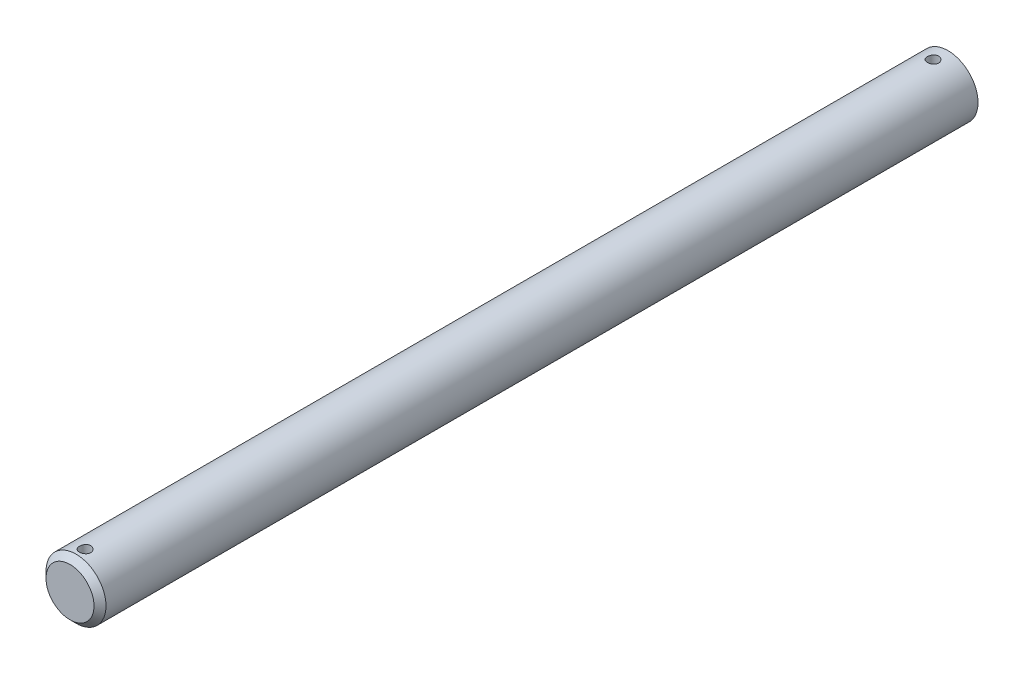
ISO-10303-21;
HEADER;
FILE_DESCRIPTION(('STEP AP214'),'2;1');
FILE_NAME('part.step','',(''),(''),'','','');
FILE_SCHEMA(('AUTOMOTIVE_DESIGN { 1 0 10303 214 1 1 1 1 }'));
ENDSEC;
DATA;
#1=APPLICATION_CONTEXT('core data for automotive mechanical design processes');
#2=APPLICATION_PROTOCOL_DEFINITION('international standard','automotive_design',2000,#1);
#3=PRODUCT_CONTEXT('',#1,'mechanical');
#4=PRODUCT('Part','Part','',(#3));
#5=PRODUCT_RELATED_PRODUCT_CATEGORY('part','',(#4));
#6=PRODUCT_DEFINITION_FORMATION('','',#4);
#7=PRODUCT_DEFINITION_CONTEXT('part definition',#1,'design');
#8=PRODUCT_DEFINITION('design','',#6,#7);
#9=PRODUCT_DEFINITION_SHAPE('','',#8);
#10=(LENGTH_UNIT() NAMED_UNIT(*) SI_UNIT(.MILLI.,.METRE.));
#11=(NAMED_UNIT(*) PLANE_ANGLE_UNIT() SI_UNIT($,.RADIAN.));
#12=(NAMED_UNIT(*) SI_UNIT($,.STERADIAN.) SOLID_ANGLE_UNIT());
#13=UNCERTAINTY_MEASURE_WITH_UNIT(LENGTH_MEASURE(1.E-05),#10,'distance_accuracy_value','');
#14=(GEOMETRIC_REPRESENTATION_CONTEXT(3) GLOBAL_UNCERTAINTY_ASSIGNED_CONTEXT((#13)) GLOBAL_UNIT_ASSIGNED_CONTEXT((#10,
#11,#12)) REPRESENTATION_CONTEXT('',''));
#15=CARTESIAN_POINT('',(0.,0.,0.));
#16=DIRECTION('',(0.,0.,1.));
#17=DIRECTION('',(1.,0.,0.));
#18=AXIS2_PLACEMENT_3D('',#15,#16,#17);
#19=CARTESIAN_POINT('',(0.,0.,304.8));
#20=DIRECTION('',(0.,0.,-1.));
#21=DIRECTION('',(-1.,0.,0.));
#22=AXIS2_PLACEMENT_3D('',#19,#20,#21);
#23=CYLINDRICAL_SURFACE('',#22,3.175);
#24=CARTESIAN_POINT('',(0.,-3.17500000000001,214.055762388));
#25=CARTESIAN_POINT('',(0.0331278493784855,-3.17499940005936,214.055761122132));
#26=CARTESIAN_POINT('',(0.0662721689897595,-3.17447616437681,214.052987804467));
#27=CARTESIAN_POINT('',(0.131626820280965,-3.17243930650301,214.041974952437));
#28=CARTESIAN_POINT('',(0.163836339741666,-3.17092484847488,214.033730804777));
#29=CARTESIAN_POINT('',(0.226366769234933,-3.16707495697542,214.012037597188));
#30=CARTESIAN_POINT('',(0.256689356240744,-3.16474026510011,213.998593237808));
#31=CARTESIAN_POINT('',(0.314645664321682,-3.1595048514429,213.966894583721));
#32=CARTESIAN_POINT('',(0.342279602808186,-3.1566041754851,213.948640678371));
#33=CARTESIAN_POINT('',(0.394407912259917,-3.15051811645857,213.907609042574));
#34=CARTESIAN_POINT('',(0.418865429028259,-3.14733001333615,213.884784889647));
#35=CARTESIAN_POINT('',(0.46362781184975,-3.14104860763278,213.835360512206));
#36=CARTESIAN_POINT('',(0.483932379579181,-3.13795531187579,213.808760016654));
#37=CARTESIAN_POINT('',(0.51996577595487,-3.13218731275362,213.752277596681));
#38=CARTESIAN_POINT('',(0.535657115316877,-3.12951611636079,213.72237136603));
#39=CARTESIAN_POINT('',(0.561778643443755,-3.12493308056008,213.660288787289));
#40=CARTESIAN_POINT('',(0.572209285923864,-3.1230211756692,213.628112635243));
#41=CARTESIAN_POINT('',(0.587395056092025,-3.120200569874,213.562797905731));
#42=CARTESIAN_POINT('',(0.592214454824666,-3.11928051754792,213.529674771297));
#43=CARTESIAN_POINT('',(0.596240425878417,-3.11851356370003,213.463078238404));
#44=CARTESIAN_POINT('',(0.595447501537276,-3.11866656594196,213.429604871624));
#45=CARTESIAN_POINT('',(0.588323450296884,-3.12001809916009,213.36372370141));
#46=CARTESIAN_POINT('',(0.582065407796811,-3.12120283233474,213.331307670137));
#47=CARTESIAN_POINT('',(0.564303860103705,-3.12446266491103,213.267993921399));
#48=CARTESIAN_POINT('',(0.552800132013024,-3.12653780214715,213.237096268514));
#49=CARTESIAN_POINT('',(0.524802287242859,-3.13135905069247,213.177482506022));
#50=CARTESIAN_POINT('',(0.508278659956946,-3.13410911079899,213.148780588738));
#51=CARTESIAN_POINT('',(0.470730932942595,-3.13996773104909,213.094529261361));
#52=CARTESIAN_POINT('',(0.449706376466777,-3.14307632756161,213.068980171626));
#53=CARTESIAN_POINT('',(0.403359563188525,-3.14936188004891,213.021337483717));
#54=CARTESIAN_POINT('',(0.377974795254084,-3.15253914125163,212.999304691558));
#55=CARTESIAN_POINT('',(0.323837314723604,-3.1585590011174,212.959801108107));
#56=CARTESIAN_POINT('',(0.29508456836402,-3.16140159642489,212.942330362555));
#57=CARTESIAN_POINT('',(0.234963886209648,-3.16643757934512,212.912437841933));
#58=CARTESIAN_POINT('',(0.203592733389713,-3.16863015282215,212.900022391288));
#59=CARTESIAN_POINT('',(0.139159898923863,-3.17211275581705,212.880654369804));
#60=CARTESIAN_POINT('',(0.106098397260249,-3.17340288121049,212.873701218644));
#61=CARTESIAN_POINT('',(0.0397464966210302,-3.17492205629787,212.86553980694));
#62=CARTESIAN_POINT('',(0.00646668626417154,-3.17516649268312,212.864248232612));
#63=CARTESIAN_POINT('',(-0.0598333703365863,-3.17460925115548,212.867223156445));
#64=CARTESIAN_POINT('',(-0.0928536292531536,-3.1738076246401,212.871489381529));
#65=CARTESIAN_POINT('',(-0.15743299937098,-3.17125791126725,212.885389536338));
#66=CARTESIAN_POINT('',(-0.189001503602657,-3.16951726067194,212.894981309507));
#67=CARTESIAN_POINT('',(-0.2500823007554,-3.16528387378086,212.919214665378));
#68=CARTESIAN_POINT('',(-0.279594453904928,-3.16279108642312,212.93385659094));
#69=CARTESIAN_POINT('',(-0.336080366506804,-3.157291557982,212.967959020113));
#70=CARTESIAN_POINT('',(-0.363022863065377,-3.1542794982553,212.987470431107));
#71=CARTESIAN_POINT('',(-0.413281147045618,-3.1480892694748,213.030689086266));
#72=CARTESIAN_POINT('',(-0.436596595436343,-3.14491108492986,213.054396722222));
#73=CARTESIAN_POINT('',(-0.479255517992192,-3.13869576292426,213.105712027068));
#74=CARTESIAN_POINT('',(-0.498542136242482,-3.1356610588829,213.133367304662));
#75=CARTESIAN_POINT('',(-0.532196179135602,-3.13012528651481,213.191574070233));
#76=CARTESIAN_POINT('',(-0.54656378659277,-3.12762419835761,213.222125450522));
#77=CARTESIAN_POINT('',(-0.569891360504025,-3.12345793983175,213.285112841562));
#78=CARTESIAN_POINT('',(-0.578877385529317,-3.12178874798387,213.317538923013));
#79=CARTESIAN_POINT('',(-0.591267071076003,-3.11946609009084,213.383474879438));
#80=CARTESIAN_POINT('',(-0.594671361418129,-3.11881250944861,213.416984631701));
#81=CARTESIAN_POINT('',(-0.595779868526289,-3.11860088672157,213.483567194541));
#82=CARTESIAN_POINT('',(-0.593573770795141,-3.11902560714799,213.516638490442));
#83=CARTESIAN_POINT('',(-0.583720477284627,-3.12088450886938,213.581929921124));
#84=CARTESIAN_POINT('',(-0.576073314010791,-3.12231868413375,213.614150060988));
#85=CARTESIAN_POINT('',(-0.555592803846081,-3.126027641217,213.676776324153));
#86=CARTESIAN_POINT('',(-0.542769168607848,-3.12830084823628,213.70718572269));
#87=CARTESIAN_POINT('',(-0.512309542245316,-3.13343285059637,213.765435726402));
#88=CARTESIAN_POINT('',(-0.494673211138123,-3.13629168730423,213.79327614991));
#89=CARTESIAN_POINT('',(-0.454777027878797,-3.14232633736512,213.846047161017));
#90=CARTESIAN_POINT('',(-0.432451906336473,-3.1455062556199,213.870927942363));
#91=CARTESIAN_POINT('',(-0.383947958425861,-3.15179405961499,213.916620061853));
#92=CARTESIAN_POINT('',(-0.357768247938244,-3.15490192863972,213.937430463827));
#93=CARTESIAN_POINT('',(-0.3020159000754,-3.1607282796232,213.974566109824));
#94=CARTESIAN_POINT('',(-0.272414837535452,-3.1634430039313,213.990849286182));
#95=CARTESIAN_POINT('',(-0.210855763856357,-3.16814048941711,214.018185325028));
#96=CARTESIAN_POINT('',(-0.17889999927051,-3.17012393770744,214.029243100109));
#97=CARTESIAN_POINT('',(-0.122375296121221,-3.17273102874592,214.04356932216));
#98=CARTESIAN_POINT('',(-0.0981367934437003,-3.17357708754789,214.048133906905));
#99=CARTESIAN_POINT('',(-0.049268557448821,-3.17471178919249,214.054230872027));
#100=CARTESIAN_POINT('',(-0.0246388340934145,-3.1750004462058,214.055763329489));
#101=CARTESIAN_POINT('',(0.,-3.17500000000001,214.055762388));
#102=B_SPLINE_CURVE_WITH_KNOTS('',3,(#24,#25,#26,#27,#28,#29,#30,#31,#32,#33,#34,#35,#36,#37,
#38,#39,#40,#41,#42,#43,#44,#45,#46,#47,#48,#49,#50,#51,#52,#53,#54,#55,#56,#57,#58,#59,#60,#61,
#62,#63,#64,#65,#66,#67,#68,#69,#70,#71,#72,#73,#74,#75,#76,#77,#78,#79,#80,#81,#82,#83,#84,#85,
#86,#87,#88,#89,#90,#91,#92,#93,#94,#95,#96,#97,#98,#99,#100,#101),.UNSPECIFIED.,.T.,.F.,(4,2,2,
2,2,2,2,2,2,2,2,2,2,2,2,2,2,2,2,2,2,2,2,2,2,2,2,2,2,2,2,2,2,2,2,2,2,2,4),(0.,0.0992934422579541,
0.198670720631257,0.29795837951975,0.397238003055786,0.49758249961658,0.59793420181311,
0.699080193564175,0.800217460363053,0.900184538548712,1.00014265136194,1.09878415868193,
1.19742985782943,1.29666707356097,1.3959143645104,1.49672583109182,1.59753830838152,
1.69847652240176,1.79940401117395,1.89884119086454,1.99827348496884,2.09692967832172,
2.19559257087284,2.2953336190078,2.3950839846395,2.49615895304337,2.59723016460248,
2.69780792915497,2.79837434413152,2.89734328229483,2.99631162921165,3.09509515682432,
3.19388566460124,3.2941552495541,3.39444786907213,3.49564344413668,3.59674369125816,
3.67059505483131,3.74444454087573),.UNSPECIFIED.);
#103=CARTESIAN_POINT('',(0.,-3.17500000000001,214.055762388));
#104=VERTEX_POINT('',#103);
#105=EDGE_CURVE('E10',#104,#104,#102,.T.);
#106=ORIENTED_EDGE('',*,*,#105,.T.);
#107=EDGE_LOOP('',(#106));
#108=FACE_BOUND('',#107,.T.);
#109=CARTESIAN_POINT('',(0.,3.17499999999999,214.055762388));
#110=CARTESIAN_POINT('',(-0.033127849378482,3.17499940005934,214.055761122132));
#111=CARTESIAN_POINT('',(-0.0662721689897559,3.1744761643768,214.052987804467));
#112=CARTESIAN_POINT('',(-0.131626820280961,3.17243930650299,214.041974952437));
#113=CARTESIAN_POINT('',(-0.163836339741662,3.17092484847486,214.033730804777));
#114=CARTESIAN_POINT('',(-0.22636676923493,3.1670749569754,214.012037597188));
#115=CARTESIAN_POINT('',(-0.256689356240741,3.16474026510009,213.998593237808));
#116=CARTESIAN_POINT('',(-0.314645664321678,3.15950485144288,213.966894583721));
#117=CARTESIAN_POINT('',(-0.342279602808182,3.15660417548508,213.948640678371));
#118=CARTESIAN_POINT('',(-0.394407912259913,3.15051811645855,213.907609042574));
#119=CARTESIAN_POINT('',(-0.418865429028255,3.14733001333614,213.884784889647));
#120=CARTESIAN_POINT('',(-0.463627811849747,3.14104860763276,213.835360512206));
#121=CARTESIAN_POINT('',(-0.483932379579178,3.13795531187577,213.808760016654));
#122=CARTESIAN_POINT('',(-0.519965775954866,3.13218731275361,213.752277596681));
#123=CARTESIAN_POINT('',(-0.535657115316873,3.12951611636078,213.72237136603));
#124=CARTESIAN_POINT('',(-0.561778643443751,3.12493308056006,213.660288787289));
#125=CARTESIAN_POINT('',(-0.57220928592386,3.12302117566918,213.628112635243));
#126=CARTESIAN_POINT('',(-0.587395056092021,3.12020056987398,213.562797905731));
#127=CARTESIAN_POINT('',(-0.592214454824663,3.11928051754791,213.529674771297));
#128=CARTESIAN_POINT('',(-0.596240425878413,3.11851356370001,213.463078238404));
#129=CARTESIAN_POINT('',(-0.595447501537272,3.11866656594194,213.429604871624));
#130=CARTESIAN_POINT('',(-0.588323450296881,3.12001809916007,213.36372370141));
#131=CARTESIAN_POINT('',(-0.582065407796807,3.12120283233472,213.331307670137));
#132=CARTESIAN_POINT('',(-0.564303860103701,3.12446266491101,213.267993921399));
#133=CARTESIAN_POINT('',(-0.55280013201302,3.12653780214713,213.237096268514));
#134=CARTESIAN_POINT('',(-0.524802287242856,3.13135905069245,213.177482506022));
#135=CARTESIAN_POINT('',(-0.508278659956943,3.13410911079897,213.148780588738));
#136=CARTESIAN_POINT('',(-0.470730932942592,3.13996773104907,213.094529261361));
#137=CARTESIAN_POINT('',(-0.449706376466774,3.1430763275616,213.068980171626));
#138=CARTESIAN_POINT('',(-0.403359563188522,3.14936188004889,213.021337483717));
#139=CARTESIAN_POINT('',(-0.377974795254081,3.15253914125161,212.999304691558));
#140=CARTESIAN_POINT('',(-0.3238373147236,3.15855900111738,212.959801108107));
#141=CARTESIAN_POINT('',(-0.295084568364017,3.16140159642487,212.942330362555));
#142=CARTESIAN_POINT('',(-0.234963886209645,3.1664375793451,212.912437841933));
#143=CARTESIAN_POINT('',(-0.20359273338971,3.16863015282214,212.900022391288));
#144=CARTESIAN_POINT('',(-0.139159898923859,3.17211275581703,212.880654369804));
#145=CARTESIAN_POINT('',(-0.106098397260246,3.17340288121047,212.873701218644));
#146=CARTESIAN_POINT('',(-0.039746496621027,3.17492205629785,212.86553980694));
#147=CARTESIAN_POINT('',(-0.0064666862641684,3.1751664926831,212.864248232612));
#148=CARTESIAN_POINT('',(0.0598333703365894,3.17460925115546,212.867223156445));
#149=CARTESIAN_POINT('',(0.0928536292531567,3.17380762464008,212.871489381529));
#150=CARTESIAN_POINT('',(0.157432999370984,3.17125791126723,212.885389536338));
#151=CARTESIAN_POINT('',(0.18900150360266,3.16951726067192,212.894981309507));
#152=CARTESIAN_POINT('',(0.250082300755403,3.16528387378084,212.919214665378));
#153=CARTESIAN_POINT('',(0.279594453904931,3.1627910864231,212.93385659094));
#154=CARTESIAN_POINT('',(0.336080366506808,3.15729155798198,212.967959020113));
#155=CARTESIAN_POINT('',(0.36302286306538,3.15427949825529,212.987470431107));
#156=CARTESIAN_POINT('',(0.413281147045622,3.14808926947478,213.030689086266));
#157=CARTESIAN_POINT('',(0.436596595436347,3.14491108492984,213.054396722222));
#158=CARTESIAN_POINT('',(0.479255517992195,3.13869576292425,213.105712027068));
#159=CARTESIAN_POINT('',(0.498542136242485,3.13566105888288,213.133367304662));
#160=CARTESIAN_POINT('',(0.532196179135605,3.13012528651479,213.191574070233));
#161=CARTESIAN_POINT('',(0.546563786592774,3.12762419835759,213.222125450522));
#162=CARTESIAN_POINT('',(0.569891360504029,3.12345793983173,213.285112841562));
#163=CARTESIAN_POINT('',(0.57887738552932,3.12178874798385,213.317538923013));
#164=CARTESIAN_POINT('',(0.591267071076007,3.11946609009082,213.383474879438));
#165=CARTESIAN_POINT('',(0.594671361418132,3.11881250944859,213.416984631701));
#166=CARTESIAN_POINT('',(0.595779868526293,3.11860088672155,213.483567194541));
#167=CARTESIAN_POINT('',(0.593573770795145,3.11902560714797,213.516638490442));
#168=CARTESIAN_POINT('',(0.58372047728463,3.12088450886936,213.581929921124));
#169=CARTESIAN_POINT('',(0.576073314010795,3.12231868413373,213.614150060988));
#170=CARTESIAN_POINT('',(0.555592803846085,3.12602764121698,213.676776324153));
#171=CARTESIAN_POINT('',(0.542769168607852,3.12830084823626,213.70718572269));
#172=CARTESIAN_POINT('',(0.512309542245319,3.13343285059635,213.765435726402));
#173=CARTESIAN_POINT('',(0.494673211138126,3.13629168730421,213.79327614991));
#174=CARTESIAN_POINT('',(0.454777027878801,3.1423263373651,213.846047161017));
#175=CARTESIAN_POINT('',(0.432451906336476,3.14550625561988,213.870927942363));
#176=CARTESIAN_POINT('',(0.383947958425865,3.15179405961497,213.916620061853));
#177=CARTESIAN_POINT('',(0.357768247938248,3.1549019286397,213.937430463827));
#178=CARTESIAN_POINT('',(0.302015900075403,3.16072827962318,213.974566109824));
#179=CARTESIAN_POINT('',(0.272414837535456,3.16344300393128,213.990849286182));
#180=CARTESIAN_POINT('',(0.210855763856361,3.16814048941709,214.018185325028));
#181=CARTESIAN_POINT('',(0.178899999270513,3.17012393770742,214.029243100109));
#182=CARTESIAN_POINT('',(0.122375296121225,3.17273102874591,214.04356932216));
#183=CARTESIAN_POINT('',(0.0981367934437038,3.17357708754787,214.048133906905));
#184=CARTESIAN_POINT('',(0.0492685574488245,3.17471178919247,214.054230872027));
#185=CARTESIAN_POINT('',(0.024638834093418,3.17500044620578,214.055763329489));
#186=CARTESIAN_POINT('',(0.,3.17499999999999,214.055762388));
#187=B_SPLINE_CURVE_WITH_KNOTS('',3,(#109,#110,#111,#112,#113,#114,#115,#116,#117,#118,#119,
#120,#121,#122,#123,#124,#125,#126,#127,#128,#129,#130,#131,#132,#133,#134,#135,#136,#137,#138,
#139,#140,#141,#142,#143,#144,#145,#146,#147,#148,#149,#150,#151,#152,#153,#154,#155,#156,#157,
#158,#159,#160,#161,#162,#163,#164,#165,#166,#167,#168,#169,#170,#171,#172,#173,#174,#175,#176,
#177,#178,#179,#180,#181,#182,#183,#184,#185,#186),.UNSPECIFIED.,.T.,.F.,(4,2,2,2,2,2,2,2,2,2,2,
2,2,2,2,2,2,2,2,2,2,2,2,2,2,2,2,2,2,2,2,2,2,2,2,2,2,2,4),(0.,0.099293442257954,
0.198670720631257,0.29795837951975,0.397238003055786,0.49758249961658,0.59793420181311,
0.699080193564175,0.800217460363054,0.900184538548712,1.00014265136195,1.09878415868193,
1.19742985782943,1.29666707356097,1.3959143645104,1.49672583109182,1.59753830838152,
1.69847652240176,1.79940401117395,1.89884119086454,1.99827348496884,2.09692967832172,
2.19559257087284,2.2953336190078,2.3950839846395,2.49615895304337,2.59723016460248,
2.69780792915497,2.79837434413152,2.89734328229483,2.99631162921165,3.09509515682432,
3.19388566460124,3.2941552495541,3.39444786907213,3.49564344413668,3.59674369125816,
3.67059505483131,3.74444454087573),.UNSPECIFIED.);
#188=CARTESIAN_POINT('',(0.,3.17499999999999,214.055762388));
#189=VERTEX_POINT('',#188);
#190=EDGE_CURVE('E45',#189,#189,#187,.T.);
#191=ORIENTED_EDGE('',*,*,#190,.T.);
#192=EDGE_LOOP('',(#191));
#193=FACE_BOUND('',#192,.T.);
#194=CARTESIAN_POINT('',(0.,-3.17500000000001,303.8078125));
#195=CARTESIAN_POINT('',(0.0331278493784956,-3.17499940005936,303.807811234132));
#196=CARTESIAN_POINT('',(0.0662721689897699,-3.17447616437681,303.805037916467));
#197=CARTESIAN_POINT('',(0.131626820280976,-3.17243930650301,303.794025064437));
#198=CARTESIAN_POINT('',(0.163836339741677,-3.17092484847488,303.785780916777));
#199=CARTESIAN_POINT('',(0.226366769234958,-3.16707495697542,303.764087709188));
#200=CARTESIAN_POINT('',(0.256689356240781,-3.16474026510011,303.750643349808));
#201=CARTESIAN_POINT('',(0.314645664321714,-3.15950485144289,303.718944695721));
#202=CARTESIAN_POINT('',(0.342279602808203,-3.15660417548509,303.700690790371));
#203=CARTESIAN_POINT('',(0.394407912259931,-3.15051811645857,303.659659154574));
#204=CARTESIAN_POINT('',(0.41886542902828,-3.14733001333615,303.636835001646));
#205=CARTESIAN_POINT('',(0.463627811849776,-3.14104860763277,303.587410624206));
#206=CARTESIAN_POINT('',(0.483932379579207,-3.13795531187578,303.560810128654));
#207=CARTESIAN_POINT('',(0.519965775954901,-3.13218731275362,303.504327708681));
#208=CARTESIAN_POINT('',(0.535657115316909,-3.12951611636079,303.47442147803));
#209=CARTESIAN_POINT('',(0.561778643443776,-3.12493308056008,303.412338899289));
#210=CARTESIAN_POINT('',(0.572209285923881,-3.1230211756692,303.380162747243));
#211=CARTESIAN_POINT('',(0.587395056092034,-3.120200569874,303.314848017731));
#212=CARTESIAN_POINT('',(0.592214454824669,-3.11928051754792,303.281724883297));
#213=CARTESIAN_POINT('',(0.596240425878417,-3.11851356370003,303.215128350404));
#214=CARTESIAN_POINT('',(0.595447501537278,-3.11866656594196,303.181654983624));
#215=CARTESIAN_POINT('',(0.58832345029689,-3.12001809916009,303.11577381341));
#216=CARTESIAN_POINT('',(0.582065407796815,-3.12120283233474,303.083357782137));
#217=CARTESIAN_POINT('',(0.564303860103707,-3.12446266491103,303.020044033399));
#218=CARTESIAN_POINT('',(0.552800132013023,-3.12653780214715,302.989146380513));
#219=CARTESIAN_POINT('',(0.524802287242861,-3.13135905069247,302.929532618022));
#220=CARTESIAN_POINT('',(0.508278659956958,-3.13410911079899,302.900830700738));
#221=CARTESIAN_POINT('',(0.470730932942623,-3.13996773104909,302.846579373361));
#222=CARTESIAN_POINT('',(0.449706376466809,-3.14307632756161,302.821030283626));
#223=CARTESIAN_POINT('',(0.403359563188558,-3.14936188004891,302.773387595718));
#224=CARTESIAN_POINT('',(0.377974795254109,-3.15253914125163,302.751354803558));
#225=CARTESIAN_POINT('',(0.323837314723599,-3.1585590011174,302.711851220107));
#226=CARTESIAN_POINT('',(0.295084568363997,-3.16140159642489,302.694380474555));
#227=CARTESIAN_POINT('',(0.234963886209613,-3.16643757934512,302.664487953933));
#228=CARTESIAN_POINT('',(0.203592733389688,-3.16863015282216,302.652072503288));
#229=CARTESIAN_POINT('',(0.139159898923856,-3.17211275581705,302.632704481804));
#230=CARTESIAN_POINT('',(0.106098397260251,-3.17340288121049,302.625751330645));
#231=CARTESIAN_POINT('',(0.0397464966210445,-3.17492205629787,302.61758991894));
#232=CARTESIAN_POINT('',(0.00646668626418795,-3.17516649268312,302.616298344612));
#233=CARTESIAN_POINT('',(-0.0598333703365708,-3.17460925115548,302.619273268446));
#234=CARTESIAN_POINT('',(-0.0928536292531409,-3.1738076246401,302.623539493529));
#235=CARTESIAN_POINT('',(-0.157432999370963,-3.17125791126725,302.637439648338));
#236=CARTESIAN_POINT('',(-0.189001503602631,-3.16951726067195,302.647031421507));
#237=CARTESIAN_POINT('',(-0.250082300755378,-3.16528387378086,302.671264777378));
#238=CARTESIAN_POINT('',(-0.279594453904919,-3.16279108642312,302.68590670294));
#239=CARTESIAN_POINT('',(-0.33608036650679,-3.157291557982,302.720009132113));
#240=CARTESIAN_POINT('',(-0.363022863065345,-3.15427949825531,302.739520543107));
#241=CARTESIAN_POINT('',(-0.413281147045584,-3.14808926947481,302.782739198266));
#242=CARTESIAN_POINT('',(-0.436596595436325,-3.14491108492986,302.806446834222));
#243=CARTESIAN_POINT('',(-0.479255517992183,-3.13869576292427,302.857762139068));
#244=CARTESIAN_POINT('',(-0.498542136242465,-3.13566105888291,302.885417416662));
#245=CARTESIAN_POINT('',(-0.532196179135576,-3.13012528651481,302.943624182233));
#246=CARTESIAN_POINT('',(-0.546563786592745,-3.12762419835762,302.974175562522));
#247=CARTESIAN_POINT('',(-0.569891360503998,-3.12345793983176,303.037162953562));
#248=CARTESIAN_POINT('',(-0.578877385529289,-3.12178874798387,303.069589035013));
#249=CARTESIAN_POINT('',(-0.591267071075983,-3.11946609009085,303.135524991438));
#250=CARTESIAN_POINT('',(-0.594671361418111,-3.11881250944861,303.169034743701));
#251=CARTESIAN_POINT('',(-0.595779868526272,-3.11860088672157,303.235617306541));
#252=CARTESIAN_POINT('',(-0.593573770795127,-3.11902560714799,303.268688602442));
#253=CARTESIAN_POINT('',(-0.583720477284618,-3.12088450886938,303.333980033124));
#254=CARTESIAN_POINT('',(-0.57607331401078,-3.12231868413375,303.366200172988));
#255=CARTESIAN_POINT('',(-0.555592803846065,-3.12602764121701,303.428826436153));
#256=CARTESIAN_POINT('',(-0.542769168607834,-3.12830084823628,303.45923583469));
#257=CARTESIAN_POINT('',(-0.512309542245301,-3.13343285059638,303.517485838402));
#258=CARTESIAN_POINT('',(-0.4946732111381,-3.13629168730423,303.54532626191));
#259=CARTESIAN_POINT('',(-0.454777027878766,-3.14232633736512,303.598097273017));
#260=CARTESIAN_POINT('',(-0.432451906336444,-3.1455062556199,303.622978054363));
#261=CARTESIAN_POINT('',(-0.383947958425829,-3.15179405961499,303.668670173853));
#262=CARTESIAN_POINT('',(-0.357768247938207,-3.15490192863972,303.689480575826));
#263=CARTESIAN_POINT('',(-0.302015900075373,-3.16072827962321,303.726616221824));
#264=CARTESIAN_POINT('',(-0.272414837535442,-3.1634430039313,303.742899398182));
#265=CARTESIAN_POINT('',(-0.21085576385636,-3.16814048941711,303.770235437028));
#266=CARTESIAN_POINT('',(-0.178899999270509,-3.17012393770744,303.781293212109));
#267=CARTESIAN_POINT('',(-0.122375296121215,-3.17273102874592,303.79561943416));
#268=CARTESIAN_POINT('',(-0.0981367934436929,-3.17357708754789,303.800184018905));
#269=CARTESIAN_POINT('',(-0.0492685574488116,-3.17471178919249,303.806280984027));
#270=CARTESIAN_POINT('',(-0.0246388340934046,-3.1750004462058,303.807813441489));
#271=CARTESIAN_POINT('',(0.,-3.17500000000001,303.8078125));
#272=B_SPLINE_CURVE_WITH_KNOTS('',3,(#194,#195,#196,#197,#198,#199,#200,#201,#202,#203,#204,
#205,#206,#207,#208,#209,#210,#211,#212,#213,#214,#215,#216,#217,#218,#219,#220,#221,#222,#223,
#224,#225,#226,#227,#228,#229,#230,#231,#232,#233,#234,#235,#236,#237,#238,#239,#240,#241,#242,
#243,#244,#245,#246,#247,#248,#249,#250,#251,#252,#253,#254,#255,#256,#257,#258,#259,#260,#261,
#262,#263,#264,#265,#266,#267,#268,#269,#270,#271),.UNSPECIFIED.,.T.,.F.,(4,2,2,2,2,2,2,2,2,2,2,
2,2,2,2,2,2,2,2,2,2,2,2,2,2,2,2,2,2,2,2,2,2,2,2,2,2,2,4),(0.,0.0992934422579537,
0.198670720631256,0.297958379519797,0.397238003055775,0.497582499616633,0.597934201813132,
0.699080193564254,0.800217460363045,0.900184538548675,1.00014265136191,1.09878415868192,
1.19742985782948,1.29666707356095,1.39591436451032,1.49672583109181,1.59753830838155,
1.69847652240177,1.79940401117393,1.89884119086451,1.99827348496881,2.09692967832168,
2.1955925708728,2.29533361900778,2.39508398463947,2.49615895304333,2.59723016460242,
2.69780792915486,2.79837434413146,2.89734328229474,2.99631162921161,3.09509515682426,
3.19388566460124,3.29415524955408,3.39444786907209,3.49564344413663,3.5967436912581,
3.67059505483126,3.74444454087568),.UNSPECIFIED.);
#273=CARTESIAN_POINT('',(0.,-3.17500000000001,303.8078125));
#274=VERTEX_POINT('',#273);
#275=EDGE_CURVE('E49',#274,#274,#272,.T.);
#276=ORIENTED_EDGE('',*,*,#275,.T.);
#277=EDGE_LOOP('',(#276));
#278=FACE_BOUND('',#277,.T.);
#279=CARTESIAN_POINT('',(0.,3.17499999999999,303.8078125));
#280=CARTESIAN_POINT('',(-0.0331278493784698,3.17499940005934,303.807811234132));
#281=CARTESIAN_POINT('',(-0.0662721689897442,3.17447616437679,303.805037916467));
#282=CARTESIAN_POINT('',(-0.13162682028095,3.17243930650299,303.794025064437));
#283=CARTESIAN_POINT('',(-0.163836339741651,3.17092484847486,303.785780916777));
#284=CARTESIAN_POINT('',(-0.226366769234933,3.1670749569754,303.764087709188));
#285=CARTESIAN_POINT('',(-0.256689356240756,3.16474026510009,303.750643349808));
#286=CARTESIAN_POINT('',(-0.314645664321688,3.15950485144288,303.718944695721));
#287=CARTESIAN_POINT('',(-0.342279602808177,3.15660417548508,303.700690790371));
#288=CARTESIAN_POINT('',(-0.394407912259905,3.15051811645856,303.659659154574));
#289=CARTESIAN_POINT('',(-0.418865429028254,3.14733001333614,303.636835001646));
#290=CARTESIAN_POINT('',(-0.46362781184975,3.14104860763276,303.587410624206));
#291=CARTESIAN_POINT('',(-0.483932379579181,3.13795531187577,303.560810128654));
#292=CARTESIAN_POINT('',(-0.519965775954875,3.1321873127536,303.504327708681));
#293=CARTESIAN_POINT('',(-0.535657115316883,3.12951611636077,303.47442147803));
#294=CARTESIAN_POINT('',(-0.56177864344375,3.12493308056007,303.412338899289));
#295=CARTESIAN_POINT('',(-0.572209285923855,3.12302117566919,303.380162747243));
#296=CARTESIAN_POINT('',(-0.587395056092009,3.12020056987399,303.314848017731));
#297=CARTESIAN_POINT('',(-0.592214454824643,3.11928051754791,303.281724883297));
#298=CARTESIAN_POINT('',(-0.596240425878392,3.11851356370001,303.215128350404));
#299=CARTESIAN_POINT('',(-0.595447501537253,3.11866656594195,303.181654983624));
#300=CARTESIAN_POINT('',(-0.588323450296865,3.12001809916008,303.11577381341));
#301=CARTESIAN_POINT('',(-0.58206540779679,3.12120283233473,303.083357782137));
#302=CARTESIAN_POINT('',(-0.564303860103681,3.12446266491101,303.020044033399));
#303=CARTESIAN_POINT('',(-0.552800132012997,3.12653780214714,302.989146380513));
#304=CARTESIAN_POINT('',(-0.524802287242835,3.13135905069245,302.929532618022));
#305=CARTESIAN_POINT('',(-0.508278659956932,3.13410911079897,302.900830700738));
#306=CARTESIAN_POINT('',(-0.470730932942597,3.13996773104907,302.846579373361));
#307=CARTESIAN_POINT('',(-0.449706376466783,3.14307632756159,302.821030283626));
#308=CARTESIAN_POINT('',(-0.403359563188532,3.14936188004889,302.773387595718));
#309=CARTESIAN_POINT('',(-0.377974795254083,3.15253914125161,302.751354803558));
#310=CARTESIAN_POINT('',(-0.323837314723573,3.15855900111738,302.711851220107));
#311=CARTESIAN_POINT('',(-0.295084568363971,3.16140159642487,302.694380474555));
#312=CARTESIAN_POINT('',(-0.234963886209588,3.16643757934511,302.664487953933));
#313=CARTESIAN_POINT('',(-0.203592733389662,3.16863015282214,302.652072503288));
#314=CARTESIAN_POINT('',(-0.13915989892383,3.17211275581703,302.632704481804));
#315=CARTESIAN_POINT('',(-0.106098397260226,3.17340288121047,302.625751330645));
#316=CARTESIAN_POINT('',(-0.0397464966210191,3.17492205629785,302.61758991894));
#317=CARTESIAN_POINT('',(-0.00646668626416251,3.1751664926831,302.616298344612));
#318=CARTESIAN_POINT('',(0.0598333703365961,3.17460925115546,302.619273268446));
#319=CARTESIAN_POINT('',(0.0928536292531661,3.17380762464008,302.623539493529));
#320=CARTESIAN_POINT('',(0.157432999370988,3.17125791126723,302.637439648338));
#321=CARTESIAN_POINT('',(0.189001503602656,3.16951726067193,302.647031421507));
#322=CARTESIAN_POINT('',(0.250082300755404,3.16528387378084,302.671264777378));
#323=CARTESIAN_POINT('',(0.279594453904944,3.1627910864231,302.68590670294));
#324=CARTESIAN_POINT('',(0.336080366506815,3.15729155798198,302.720009132113));
#325=CARTESIAN_POINT('',(0.36302286306537,3.15427949825529,302.739520543107));
#326=CARTESIAN_POINT('',(0.413281147045609,3.14808926947478,302.782739198266));
#327=CARTESIAN_POINT('',(0.436596595436351,3.14491108492984,302.806446834222));
#328=CARTESIAN_POINT('',(0.479255517992208,3.13869576292424,302.857762139068));
#329=CARTESIAN_POINT('',(0.49854213624249,3.13566105888288,302.885417416662));
#330=CARTESIAN_POINT('',(0.532196179135601,3.13012528651479,302.943624182233));
#331=CARTESIAN_POINT('',(0.54656378659277,3.1276241983576,302.974175562522));
#332=CARTESIAN_POINT('',(0.569891360504023,3.12345793983173,303.037162953562));
#333=CARTESIAN_POINT('',(0.578877385529315,3.12178874798385,303.069589035013));
#334=CARTESIAN_POINT('',(0.591267071076009,3.11946609009082,303.135524991438));
#335=CARTESIAN_POINT('',(0.594671361418136,3.11881250944859,303.169034743701));
#336=CARTESIAN_POINT('',(0.595779868526297,3.11860088672155,303.235617306541));
#337=CARTESIAN_POINT('',(0.593573770795153,3.11902560714796,303.268688602442));
#338=CARTESIAN_POINT('',(0.583720477284644,3.12088450886935,303.333980033124));
#339=CARTESIAN_POINT('',(0.576073314010806,3.12231868413373,303.366200172988));
#340=CARTESIAN_POINT('',(0.555592803846091,3.12602764121698,303.428826436153));
#341=CARTESIAN_POINT('',(0.54276916860786,3.12830084823626,303.45923583469));
#342=CARTESIAN_POINT('',(0.512309542245326,3.13343285059635,303.517485838402));
#343=CARTESIAN_POINT('',(0.494673211138126,3.13629168730421,303.54532626191));
#344=CARTESIAN_POINT('',(0.454777027878792,3.1423263373651,303.598097273017));
#345=CARTESIAN_POINT('',(0.432451906336469,3.14550625561988,303.622978054363));
#346=CARTESIAN_POINT('',(0.383947958425855,3.15179405961497,303.668670173853));
#347=CARTESIAN_POINT('',(0.357768247938233,3.1549019286397,303.689480575826));
#348=CARTESIAN_POINT('',(0.302015900075392,3.16072827962318,303.726616221824));
#349=CARTESIAN_POINT('',(0.272414837535453,3.16344300393128,303.742899398182));
#350=CARTESIAN_POINT('',(0.210855763856371,3.16814048941709,303.770235437028));
#351=CARTESIAN_POINT('',(0.178899999270528,3.17012393770742,303.781293212109));
#352=CARTESIAN_POINT('',(0.122375296121242,3.1727310287459,303.79561943416));
#353=CARTESIAN_POINT('',(0.0981367934437188,3.17357708754787,303.800184018905));
#354=CARTESIAN_POINT('',(0.0492685574488371,3.17471178919247,303.806280984027));
#355=CARTESIAN_POINT('',(0.0246388340934303,3.17500044620578,303.807813441489));
#356=CARTESIAN_POINT('',(0.,3.17499999999999,303.8078125));
#357=B_SPLINE_CURVE_WITH_KNOTS('',3,(#279,#280,#281,#282,#283,#284,#285,#286,#287,#288,#289,
#290,#291,#292,#293,#294,#295,#296,#297,#298,#299,#300,#301,#302,#303,#304,#305,#306,#307,#308,
#309,#310,#311,#312,#313,#314,#315,#316,#317,#318,#319,#320,#321,#322,#323,#324,#325,#326,#327,
#328,#329,#330,#331,#332,#333,#334,#335,#336,#337,#338,#339,#340,#341,#342,#343,#344,#345,#346,
#347,#348,#349,#350,#351,#352,#353,#354,#355,#356),.UNSPECIFIED.,.T.,.F.,(4,2,2,2,2,2,2,2,2,2,2,
2,2,2,2,2,2,2,2,2,2,2,2,2,2,2,2,2,2,2,2,2,2,2,2,2,2,2,4),(0.,0.0992934422579536,
0.198670720631256,0.297958379519797,0.397238003055775,0.497582499616632,0.597934201813132,
0.699080193564254,0.800217460363045,0.900184538548675,1.00014265136191,1.09878415868192,
1.19742985782948,1.29666707356095,1.39591436451032,1.49672583109181,1.59753830838155,
1.69847652240177,1.79940401117393,1.89884119086451,1.99827348496881,2.09692967832168,
2.1955925708728,2.29533361900778,2.39508398463947,2.49615895304333,2.59723016460242,
2.69780792915486,2.79837434413146,2.89734328229474,2.99631162921161,3.09509515682425,
3.19388566460124,3.29415524955408,3.39444786907209,3.49564344413664,3.5967436912581,
3.67059505483125,3.74444454087568),.UNSPECIFIED.);
#358=CARTESIAN_POINT('',(0.,3.17499999999999,303.8078125));
#359=VERTEX_POINT('',#358);
#360=EDGE_CURVE('E53',#359,#359,#357,.T.);
#361=ORIENTED_EDGE('',*,*,#360,.T.);
#362=EDGE_LOOP('',(#361));
#363=FACE_BOUND('',#362,.T.);
#364=CARTESIAN_POINT('',(0.,0.,211.872949888));
#365=DIRECTION('',(0.,0.,1.));
#366=DIRECTION('',(1.,0.,0.));
#367=AXIS2_PLACEMENT_3D('',#364,#365,#366);
#368=CIRCLE('',#367,3.175);
#369=CARTESIAN_POINT('',(3.175,0.,211.872949888));
#370=VERTEX_POINT('',#369);
#371=EDGE_CURVE('E88',#370,#370,#368,.T.);
#372=ORIENTED_EDGE('',*,*,#371,.T.);
#373=EDGE_LOOP('',(#372));
#374=FACE_BOUND('',#373,.T.);
#375=CARTESIAN_POINT('',(0.,0.,304.165));
#376=DIRECTION('',(0.,0.,1.));
#377=DIRECTION('',(1.,0.,0.));
#378=AXIS2_PLACEMENT_3D('',#375,#376,#377);
#379=CIRCLE('',#378,3.175);
#380=CARTESIAN_POINT('',(3.175,0.,304.165));
#381=VERTEX_POINT('',#380);
#382=EDGE_CURVE('E85',#381,#381,#379,.F.);
#383=ORIENTED_EDGE('',*,*,#382,.T.);
#384=EDGE_LOOP('',(#383));
#385=FACE_BOUND('',#384,.T.);
#386=ADVANCED_FACE('F34',(#108,#193,#278,#363,#374,#385),#23,.T.);
#387=CARTESIAN_POINT('',(0.,0.,304.8));
#388=DIRECTION('',(0.,0.,1.));
#389=DIRECTION('',(1.,0.,0.));
#390=AXIS2_PLACEMENT_3D('',#387,#388,#389);
#391=PLANE('',#390);
#392=CARTESIAN_POINT('',(0.,0.,304.8));
#393=DIRECTION('',(0.,0.,1.));
#394=DIRECTION('',(1.,0.,0.));
#395=AXIS2_PLACEMENT_3D('',#392,#393,#394);
#396=CIRCLE('',#395,2.54000000000021);
#397=CARTESIAN_POINT('',(2.54000000000021,0.,304.8));
#398=VERTEX_POINT('',#397);
#399=EDGE_CURVE('E82',#398,#398,#396,.T.);
#400=ORIENTED_EDGE('',*,*,#399,.T.);
#401=EDGE_LOOP('',(#400));
#402=FACE_BOUND('',#401,.T.);
#403=ADVANCED_FACE('F98',(#402),#391,.T.);
#404=CARTESIAN_POINT('',(0.,0.,304.8));
#405=DIRECTION('',(0.,0.,-1.));
#406=DIRECTION('',(-1.,0.,0.));
#407=AXIS2_PLACEMENT_3D('',#404,#405,#406);
#408=CONICAL_SURFACE('',#407,2.54000000000021,0.785398163397418);
#409=ORIENTED_EDGE('',*,*,#382,.F.);
#410=EDGE_LOOP('',(#409));
#411=FACE_BOUND('',#410,.T.);
#412=ORIENTED_EDGE('',*,*,#399,.F.);
#413=EDGE_LOOP('',(#412));
#414=FACE_BOUND('',#413,.T.);
#415=ADVANCED_FACE('F36',(#411,#414),#408,.T.);
#416=CARTESIAN_POINT('',(0.,0.,211.872949888));
#417=DIRECTION('',(0.,0.,1.));
#418=DIRECTION('',(1.,0.,0.));
#419=AXIS2_PLACEMENT_3D('',#416,#417,#418);
#420=PLANE('',#419);
#421=ORIENTED_EDGE('',*,*,#371,.F.);
#422=EDGE_LOOP('',(#421));
#423=FACE_BOUND('',#422,.T.);
#424=ADVANCED_FACE('F74',(#423),#420,.F.);
#425=CARTESIAN_POINT('',(0.,-3.17500000000001,303.2125));
#426=DIRECTION('',(0.,1.,0.));
#427=DIRECTION('',(0.,0.,1.));
#428=AXIS2_PLACEMENT_3D('',#425,#426,#427);
#429=CYLINDRICAL_SURFACE('',#428,0.595312500000002);
#430=ORIENTED_EDGE('',*,*,#360,.F.);
#431=EDGE_LOOP('',(#430));
#432=FACE_BOUND('',#431,.T.);
#433=ORIENTED_EDGE('',*,*,#275,.F.);
#434=EDGE_LOOP('',(#433));
#435=FACE_BOUND('',#434,.T.);
#436=ADVANCED_FACE('F68',(#432,#435),#429,.F.);
#437=CARTESIAN_POINT('',(0.,-3.17500000000001,213.460449888));
#438=DIRECTION('',(0.,1.,0.));
#439=DIRECTION('',(0.,0.,1.));
#440=AXIS2_PLACEMENT_3D('',#437,#438,#439);
#441=CYLINDRICAL_SURFACE('',#440,0.595312500000008);
#442=ORIENTED_EDGE('',*,*,#190,.F.);
#443=EDGE_LOOP('',(#442));
#444=FACE_BOUND('',#443,.T.);
#445=ORIENTED_EDGE('',*,*,#105,.F.);
#446=EDGE_LOOP('',(#445));
#447=FACE_BOUND('',#446,.T.);
#448=ADVANCED_FACE('F65',(#444,#447),#441,.F.);
#449=CLOSED_SHELL('',(#386,#403,#415,#424,#436,#448));
#450=MANIFOLD_SOLID_BREP('B2',#449);
#451=ADVANCED_BREP_SHAPE_REPRESENTATION('',(#18,#450),#14);
#452=SHAPE_DEFINITION_REPRESENTATION(#9,#451);
ENDSEC;
END-ISO-10303-21;
